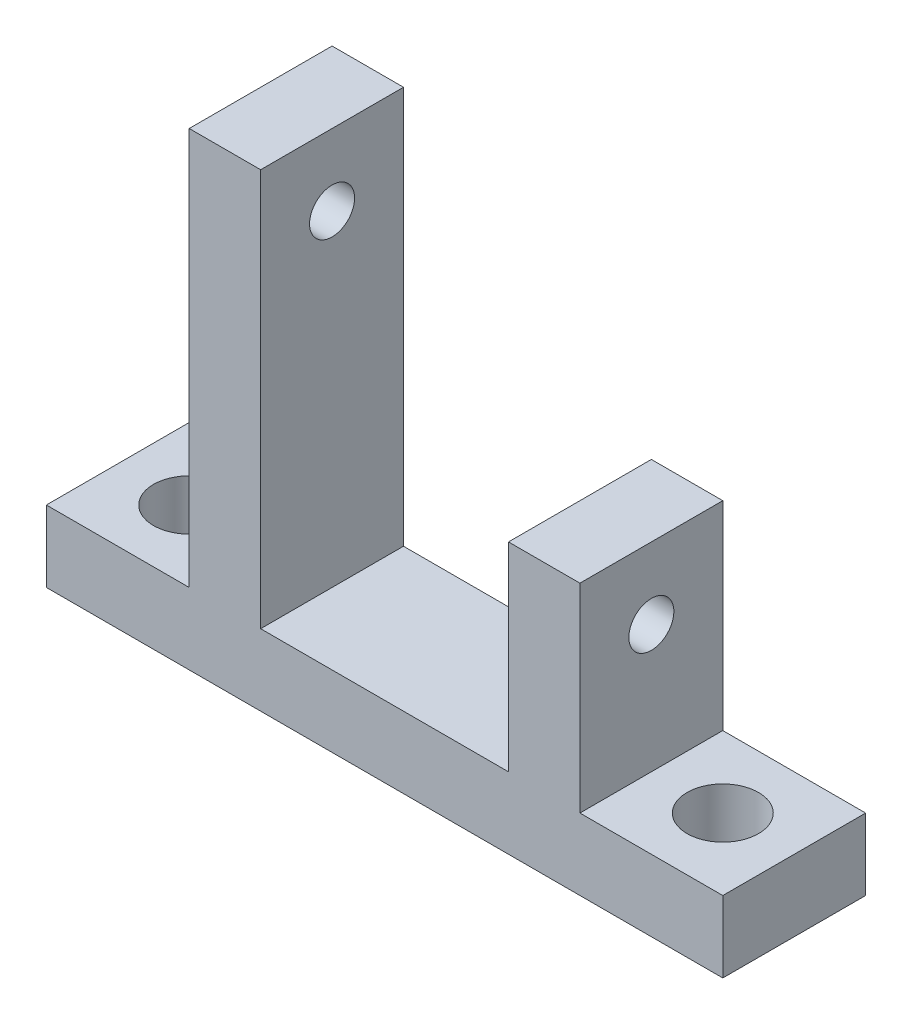
ISO-10303-21;
HEADER;
FILE_DESCRIPTION(('STEP AP214'),'2;1');
FILE_NAME('part.step','',(''),(''),'','','');
FILE_SCHEMA(('AUTOMOTIVE_DESIGN { 1 0 10303 214 1 1 1 1 }'));
ENDSEC;
DATA;
#1=APPLICATION_CONTEXT('core data for automotive mechanical design processes');
#2=APPLICATION_PROTOCOL_DEFINITION('international standard','automotive_design',2000,#1);
#3=PRODUCT_CONTEXT('',#1,'mechanical');
#4=PRODUCT('Part','Part','',(#3));
#5=PRODUCT_RELATED_PRODUCT_CATEGORY('part','',(#4));
#6=PRODUCT_DEFINITION_FORMATION('','',#4);
#7=PRODUCT_DEFINITION_CONTEXT('part definition',#1,'design');
#8=PRODUCT_DEFINITION('design','',#6,#7);
#9=PRODUCT_DEFINITION_SHAPE('','',#8);
#10=(LENGTH_UNIT() NAMED_UNIT(*) SI_UNIT(.MILLI.,.METRE.));
#11=(NAMED_UNIT(*) PLANE_ANGLE_UNIT() SI_UNIT($,.RADIAN.));
#12=(NAMED_UNIT(*) SI_UNIT($,.STERADIAN.) SOLID_ANGLE_UNIT());
#13=UNCERTAINTY_MEASURE_WITH_UNIT(LENGTH_MEASURE(1.E-05),#10,'distance_accuracy_value','');
#14=(GEOMETRIC_REPRESENTATION_CONTEXT(3) GLOBAL_UNCERTAINTY_ASSIGNED_CONTEXT((#13)) GLOBAL_UNIT_ASSIGNED_CONTEXT((#10,
#11,#12)) REPRESENTATION_CONTEXT('',''));
#15=CARTESIAN_POINT('',(0.,0.,0.));
#16=DIRECTION('',(0.,0.,1.));
#17=DIRECTION('',(1.,0.,0.));
#18=AXIS2_PLACEMENT_3D('',#15,#16,#17);
#19=CARTESIAN_POINT('',(0.,3.175,12.7));
#20=DIRECTION('',(0.,-1.,0.));
#21=DIRECTION('',(1.,0.,0.));
#22=AXIS2_PLACEMENT_3D('',#19,#20,#21);
#23=PLANE('',#22);
#24=DIRECTION('',(-1.,0.,0.));
#25=VECTOR('',#24,1.);
#26=CARTESIAN_POINT('',(0.,3.175,0.));
#27=LINE('',#26,#25);
#28=CARTESIAN_POINT('',(11.0166785,3.175,0.));
#29=VERTEX_POINT('',#28);
#30=CARTESIAN_POINT('',(-11.0166785,3.175,0.));
#31=VERTEX_POINT('',#30);
#32=EDGE_CURVE('E153',#29,#31,#27,.T.);
#33=ORIENTED_EDGE('',*,*,#32,.T.);
#34=DIRECTION('',(0.,0.,-1.));
#35=VECTOR('',#34,1.);
#36=CARTESIAN_POINT('',(-11.0166785,3.175,12.7));
#37=LINE('',#36,#35);
#38=CARTESIAN_POINT('',(-11.0166785,3.175,12.7));
#39=VERTEX_POINT('',#38);
#40=EDGE_CURVE('E11',#39,#31,#37,.T.);
#41=ORIENTED_EDGE('',*,*,#40,.F.);
#42=DIRECTION('',(-1.,0.,0.));
#43=VECTOR('',#42,1.);
#44=CARTESIAN_POINT('',(0.,3.175,12.7));
#45=LINE('',#44,#43);
#46=CARTESIAN_POINT('',(11.0166785,3.175,12.7));
#47=VERTEX_POINT('',#46);
#48=EDGE_CURVE('E100',#47,#39,#45,.T.);
#49=ORIENTED_EDGE('',*,*,#48,.F.);
#50=DIRECTION('',(0.,0.,-1.));
#51=VECTOR('',#50,1.);
#52=CARTESIAN_POINT('',(11.0166785,3.175,12.7));
#53=LINE('',#52,#51);
#54=EDGE_CURVE('E51',#47,#29,#53,.T.);
#55=ORIENTED_EDGE('',*,*,#54,.T.);
#56=EDGE_LOOP('',(#33,#41,#49,#55));
#57=FACE_BOUND('',#56,.T.);
#58=ADVANCED_FACE('F35',(#57),#23,.F.);
#59=CARTESIAN_POINT('',(-11.0166785,0.,12.7));
#60=DIRECTION('',(1.,0.,0.));
#61=DIRECTION('',(0.,0.,-1.));
#62=AXIS2_PLACEMENT_3D('',#59,#60,#61);
#63=PLANE('',#62);
#64=CARTESIAN_POINT('',(-11.0166785,32.16148,6.35));
#65=DIRECTION('',(1.,0.,0.));
#66=DIRECTION('',(0.,0.,-1.));
#67=AXIS2_PLACEMENT_3D('',#64,#65,#66);
#68=CIRCLE('',#67,2.);
#69=CARTESIAN_POINT('',(-11.0166785,32.16148,4.35));
#70=VERTEX_POINT('',#69);
#71=EDGE_CURVE('E317',#70,#70,#68,.F.);
#72=ORIENTED_EDGE('',*,*,#71,.T.);
#73=EDGE_LOOP('',(#72));
#74=FACE_BOUND('',#73,.T.);
#75=DIRECTION('',(0.,-1.,0.));
#76=VECTOR('',#75,1.);
#77=CARTESIAN_POINT('',(-11.0166785,0.,0.));
#78=LINE('',#77,#76);
#79=CARTESIAN_POINT('',(-11.0166785,38.51148,0.));
#80=VERTEX_POINT('',#79);
#81=EDGE_CURVE('E155',#80,#31,#78,.T.);
#82=ORIENTED_EDGE('',*,*,#81,.F.);
#83=DIRECTION('',(0.,0.,-1.));
#84=VECTOR('',#83,1.);
#85=CARTESIAN_POINT('',(-11.0166785,38.51148,12.7));
#86=LINE('',#85,#84);
#87=CARTESIAN_POINT('',(-11.0166785,38.51148,12.7));
#88=VERTEX_POINT('',#87);
#89=EDGE_CURVE('E43',#88,#80,#86,.T.);
#90=ORIENTED_EDGE('',*,*,#89,.F.);
#91=DIRECTION('',(0.,-1.,0.));
#92=VECTOR('',#91,1.);
#93=CARTESIAN_POINT('',(-11.0166785,0.,12.7));
#94=LINE('',#93,#92);
#95=EDGE_CURVE('E214',#88,#39,#94,.T.);
#96=ORIENTED_EDGE('',*,*,#95,.T.);
#97=ORIENTED_EDGE('',*,*,#40,.T.);
#98=EDGE_LOOP('',(#82,#90,#96,#97));
#99=FACE_BOUND('',#98,.T.);
#100=ADVANCED_FACE('F213',(#74,#99),#63,.T.);
#101=CARTESIAN_POINT('',(0.,38.51148,12.7));
#102=DIRECTION('',(0.,-1.,0.));
#103=DIRECTION('',(0.,0.,-1.));
#104=AXIS2_PLACEMENT_3D('',#101,#102,#103);
#105=PLANE('',#104);
#106=DIRECTION('',(-1.,0.,0.));
#107=VECTOR('',#106,1.);
#108=CARTESIAN_POINT('',(0.,38.51148,0.));
#109=LINE('',#108,#107);
#110=CARTESIAN_POINT('',(-17.3666785,38.51148,0.));
#111=VERTEX_POINT('',#110);
#112=EDGE_CURVE('E159',#80,#111,#109,.T.);
#113=ORIENTED_EDGE('',*,*,#112,.T.);
#114=DIRECTION('',(0.,0.,-1.));
#115=VECTOR('',#114,1.);
#116=CARTESIAN_POINT('',(-17.3666785,38.51148,12.7));
#117=LINE('',#116,#115);
#118=CARTESIAN_POINT('',(-17.3666785,38.51148,12.7));
#119=VERTEX_POINT('',#118);
#120=EDGE_CURVE('E199',#119,#111,#117,.T.);
#121=ORIENTED_EDGE('',*,*,#120,.F.);
#122=DIRECTION('',(-1.,0.,0.));
#123=VECTOR('',#122,1.);
#124=CARTESIAN_POINT('',(0.,38.51148,12.7));
#125=LINE('',#124,#123);
#126=EDGE_CURVE('E205',#88,#119,#125,.T.);
#127=ORIENTED_EDGE('',*,*,#126,.F.);
#128=ORIENTED_EDGE('',*,*,#89,.T.);
#129=EDGE_LOOP('',(#113,#121,#127,#128));
#130=FACE_BOUND('',#129,.T.);
#131=ADVANCED_FACE('F203',(#130),#105,.F.);
#132=CARTESIAN_POINT('',(-17.3666785,0.,12.7));
#133=DIRECTION('',(-1.,0.,0.));
#134=DIRECTION('',(0.,0.,1.));
#135=AXIS2_PLACEMENT_3D('',#132,#133,#134);
#136=PLANE('',#135);
#137=CARTESIAN_POINT('',(-17.3666785,32.16148,6.35));
#138=DIRECTION('',(-1.,0.,0.));
#139=DIRECTION('',(0.,0.,1.));
#140=AXIS2_PLACEMENT_3D('',#137,#138,#139);
#141=CIRCLE('',#140,2.);
#142=CARTESIAN_POINT('',(-17.3666785,32.16148,8.35));
#143=VERTEX_POINT('',#142);
#144=EDGE_CURVE('E309',#143,#143,#141,.T.);
#145=ORIENTED_EDGE('',*,*,#144,.F.);
#146=EDGE_LOOP('',(#145));
#147=FACE_BOUND('',#146,.T.);
#148=DIRECTION('',(0.,1.,0.));
#149=VECTOR('',#148,1.);
#150=CARTESIAN_POINT('',(-17.3666785,0.,0.));
#151=LINE('',#150,#149);
#152=CARTESIAN_POINT('',(-17.3666785,3.175,0.));
#153=VERTEX_POINT('',#152);
#154=EDGE_CURVE('E162',#153,#111,#151,.T.);
#155=ORIENTED_EDGE('',*,*,#154,.F.);
#156=DIRECTION('',(0.,0.,-1.));
#157=VECTOR('',#156,1.);
#158=CARTESIAN_POINT('',(-17.3666785,3.175,12.7));
#159=LINE('',#158,#157);
#160=CARTESIAN_POINT('',(-17.3666785,3.175,12.7));
#161=VERTEX_POINT('',#160);
#162=EDGE_CURVE('E197',#161,#153,#159,.T.);
#163=ORIENTED_EDGE('',*,*,#162,.F.);
#164=DIRECTION('',(0.,1.,0.));
#165=VECTOR('',#164,1.);
#166=CARTESIAN_POINT('',(-17.3666785,0.,12.7));
#167=LINE('',#166,#165);
#168=EDGE_CURVE('E280',#161,#119,#167,.T.);
#169=ORIENTED_EDGE('',*,*,#168,.T.);
#170=ORIENTED_EDGE('',*,*,#120,.T.);
#171=EDGE_LOOP('',(#155,#163,#169,#170));
#172=FACE_BOUND('',#171,.T.);
#173=ADVANCED_FACE('F235',(#147,#172),#136,.T.);
#174=CARTESIAN_POINT('',(0.,3.175,12.7));
#175=DIRECTION('',(0.,-1.,0.));
#176=DIRECTION('',(1.,0.,0.));
#177=AXIS2_PLACEMENT_3D('',#174,#175,#176);
#178=PLANE('',#177);
#179=CARTESIAN_POINT('',(-23.7166785,3.17499999999999,6.35000000000001));
#180=DIRECTION('',(0.,1.,0.));
#181=DIRECTION('',(-1.,0.,0.));
#182=AXIS2_PLACEMENT_3D('',#179,#180,#181);
#183=CIRCLE('',#182,3.175);
#184=CARTESIAN_POINT('',(-26.8916785,3.17499999999999,6.35000000000001));
#185=VERTEX_POINT('',#184);
#186=EDGE_CURVE('E271',#185,#185,#183,.T.);
#187=ORIENTED_EDGE('',*,*,#186,.F.);
#188=EDGE_LOOP('',(#187));
#189=FACE_BOUND('',#188,.T.);
#190=DIRECTION('',(-1.,0.,0.));
#191=VECTOR('',#190,1.);
#192=CARTESIAN_POINT('',(0.,3.175,0.));
#193=LINE('',#192,#191);
#194=CARTESIAN_POINT('',(-30.0666785,3.175,0.));
#195=VERTEX_POINT('',#194);
#196=EDGE_CURVE('E165',#153,#195,#193,.T.);
#197=ORIENTED_EDGE('',*,*,#196,.T.);
#198=DIRECTION('',(0.,0.,-1.));
#199=VECTOR('',#198,1.);
#200=CARTESIAN_POINT('',(-30.0666785,3.175,12.7));
#201=LINE('',#200,#199);
#202=CARTESIAN_POINT('',(-30.0666785,3.175,12.7));
#203=VERTEX_POINT('',#202);
#204=EDGE_CURVE('E195',#203,#195,#201,.T.);
#205=ORIENTED_EDGE('',*,*,#204,.F.);
#206=DIRECTION('',(-1.,0.,0.));
#207=VECTOR('',#206,1.);
#208=CARTESIAN_POINT('',(0.,3.175,12.7));
#209=LINE('',#208,#207);
#210=EDGE_CURVE('E283',#161,#203,#209,.T.);
#211=ORIENTED_EDGE('',*,*,#210,.F.);
#212=ORIENTED_EDGE('',*,*,#162,.T.);
#213=EDGE_LOOP('',(#197,#205,#211,#212));
#214=FACE_BOUND('',#213,.T.);
#215=ADVANCED_FACE('F241',(#189,#214),#178,.F.);
#216=CARTESIAN_POINT('',(-30.0666785,0.,12.7));
#217=DIRECTION('',(-1.,0.,0.));
#218=DIRECTION('',(0.,0.,1.));
#219=AXIS2_PLACEMENT_3D('',#216,#217,#218);
#220=PLANE('',#219);
#221=DIRECTION('',(0.,1.,0.));
#222=VECTOR('',#221,1.);
#223=CARTESIAN_POINT('',(-30.0666785,0.,0.));
#224=LINE('',#223,#222);
#225=CARTESIAN_POINT('',(-30.0666785,-3.175,0.));
#226=VERTEX_POINT('',#225);
#227=EDGE_CURVE('E168',#226,#195,#224,.T.);
#228=ORIENTED_EDGE('',*,*,#227,.F.);
#229=DIRECTION('',(0.,0.,-1.));
#230=VECTOR('',#229,1.);
#231=CARTESIAN_POINT('',(-30.0666785,-3.175,12.7));
#232=LINE('',#231,#230);
#233=CARTESIAN_POINT('',(-30.0666785,-3.175,12.7));
#234=VERTEX_POINT('',#233);
#235=EDGE_CURVE('E193',#234,#226,#232,.T.);
#236=ORIENTED_EDGE('',*,*,#235,.F.);
#237=DIRECTION('',(0.,1.,0.));
#238=VECTOR('',#237,1.);
#239=CARTESIAN_POINT('',(-30.0666785,0.,12.7));
#240=LINE('',#239,#238);
#241=EDGE_CURVE('E285',#234,#203,#240,.T.);
#242=ORIENTED_EDGE('',*,*,#241,.T.);
#243=ORIENTED_EDGE('',*,*,#204,.T.);
#244=EDGE_LOOP('',(#228,#236,#242,#243));
#245=FACE_BOUND('',#244,.T.);
#246=ADVANCED_FACE('F245',(#245),#220,.T.);
#247=CARTESIAN_POINT('',(0.,-3.175,12.7));
#248=DIRECTION('',(0.,-1.,0.));
#249=DIRECTION('',(1.,0.,0.));
#250=AXIS2_PLACEMENT_3D('',#247,#248,#249);
#251=PLANE('',#250);
#252=CARTESIAN_POINT('',(-23.7166785,-3.175,6.35000000000001));
#253=DIRECTION('',(0.,-1.,0.));
#254=DIRECTION('',(1.,0.,0.));
#255=AXIS2_PLACEMENT_3D('',#252,#253,#254);
#256=CIRCLE('',#255,3.175);
#257=CARTESIAN_POINT('',(-20.5416785,-3.175,6.35000000000001));
#258=VERTEX_POINT('',#257);
#259=EDGE_CURVE('E312',#258,#258,#256,.F.);
#260=ORIENTED_EDGE('',*,*,#259,.T.);
#261=EDGE_LOOP('',(#260));
#262=FACE_BOUND('',#261,.T.);
#263=CARTESIAN_POINT('',(23.7166785,-3.175,6.35));
#264=DIRECTION('',(0.,-1.,0.));
#265=DIRECTION('',(1.,0.,0.));
#266=AXIS2_PLACEMENT_3D('',#263,#264,#265);
#267=CIRCLE('',#266,3.175);
#268=CARTESIAN_POINT('',(26.8916785,-3.175,6.35));
#269=VERTEX_POINT('',#268);
#270=EDGE_CURVE('E274',#269,#269,#267,.F.);
#271=ORIENTED_EDGE('',*,*,#270,.T.);
#272=EDGE_LOOP('',(#271));
#273=FACE_BOUND('',#272,.T.);
#274=DIRECTION('',(-1.,0.,0.));
#275=VECTOR('',#274,1.);
#276=CARTESIAN_POINT('',(0.,-3.175,0.));
#277=LINE('',#276,#275);
#278=CARTESIAN_POINT('',(30.0666785,-3.175,0.));
#279=VERTEX_POINT('',#278);
#280=EDGE_CURVE('E171',#279,#226,#277,.T.);
#281=ORIENTED_EDGE('',*,*,#280,.F.);
#282=DIRECTION('',(0.,0.,-1.));
#283=VECTOR('',#282,1.);
#284=CARTESIAN_POINT('',(30.0666785,-3.175,12.7));
#285=LINE('',#284,#283);
#286=CARTESIAN_POINT('',(30.0666785,-3.175,12.7));
#287=VERTEX_POINT('',#286);
#288=EDGE_CURVE('E191',#287,#279,#285,.T.);
#289=ORIENTED_EDGE('',*,*,#288,.F.);
#290=DIRECTION('',(-1.,0.,0.));
#291=VECTOR('',#290,1.);
#292=CARTESIAN_POINT('',(0.,-3.175,12.7));
#293=LINE('',#292,#291);
#294=EDGE_CURVE('E288',#287,#234,#293,.T.);
#295=ORIENTED_EDGE('',*,*,#294,.T.);
#296=ORIENTED_EDGE('',*,*,#235,.T.);
#297=EDGE_LOOP('',(#281,#289,#295,#296));
#298=FACE_BOUND('',#297,.T.);
#299=ADVANCED_FACE('F249',(#262,#273,#298),#251,.T.);
#300=CARTESIAN_POINT('',(30.0666785,0.,12.7));
#301=DIRECTION('',(-1.,0.,0.));
#302=DIRECTION('',(0.,0.,1.));
#303=AXIS2_PLACEMENT_3D('',#300,#301,#302);
#304=PLANE('',#303);
#305=DIRECTION('',(0.,1.,0.));
#306=VECTOR('',#305,1.);
#307=CARTESIAN_POINT('',(30.0666785,0.,0.));
#308=LINE('',#307,#306);
#309=CARTESIAN_POINT('',(30.0666785,3.175,0.));
#310=VERTEX_POINT('',#309);
#311=EDGE_CURVE('E174',#279,#310,#308,.T.);
#312=ORIENTED_EDGE('',*,*,#311,.T.);
#313=DIRECTION('',(0.,0.,-1.));
#314=VECTOR('',#313,1.);
#315=CARTESIAN_POINT('',(30.0666785,3.175,12.7));
#316=LINE('',#315,#314);
#317=CARTESIAN_POINT('',(30.0666785,3.175,12.7));
#318=VERTEX_POINT('',#317);
#319=EDGE_CURVE('E189',#318,#310,#316,.T.);
#320=ORIENTED_EDGE('',*,*,#319,.F.);
#321=DIRECTION('',(0.,1.,0.));
#322=VECTOR('',#321,1.);
#323=CARTESIAN_POINT('',(30.0666785,0.,12.7));
#324=LINE('',#323,#322);
#325=EDGE_CURVE('E291',#287,#318,#324,.T.);
#326=ORIENTED_EDGE('',*,*,#325,.F.);
#327=ORIENTED_EDGE('',*,*,#288,.T.);
#328=EDGE_LOOP('',(#312,#320,#326,#327));
#329=FACE_BOUND('',#328,.T.);
#330=ADVANCED_FACE('F253',(#329),#304,.F.);
#331=CARTESIAN_POINT('',(0.,3.175,12.7));
#332=DIRECTION('',(0.,1.,0.));
#333=DIRECTION('',(-1.,0.,0.));
#334=AXIS2_PLACEMENT_3D('',#331,#332,#333);
#335=PLANE('',#334);
#336=CARTESIAN_POINT('',(23.7166785,3.17500000000001,6.35));
#337=DIRECTION('',(0.,1.,0.));
#338=DIRECTION('',(-1.,0.,0.));
#339=AXIS2_PLACEMENT_3D('',#336,#337,#338);
#340=CIRCLE('',#339,3.175);
#341=CARTESIAN_POINT('',(20.5416785,3.17500000000001,6.35));
#342=VERTEX_POINT('',#341);
#343=EDGE_CURVE('E308',#342,#342,#340,.T.);
#344=ORIENTED_EDGE('',*,*,#343,.F.);
#345=EDGE_LOOP('',(#344));
#346=FACE_BOUND('',#345,.T.);
#347=DIRECTION('',(1.,0.,0.));
#348=VECTOR('',#347,1.);
#349=CARTESIAN_POINT('',(0.,3.175,0.));
#350=LINE('',#349,#348);
#351=CARTESIAN_POINT('',(17.3666785,3.175,0.));
#352=VERTEX_POINT('',#351);
#353=EDGE_CURVE('E177',#352,#310,#350,.T.);
#354=ORIENTED_EDGE('',*,*,#353,.F.);
#355=DIRECTION('',(0.,0.,-1.));
#356=VECTOR('',#355,1.);
#357=CARTESIAN_POINT('',(17.3666785,3.175,12.7));
#358=LINE('',#357,#356);
#359=CARTESIAN_POINT('',(17.3666785,3.175,12.7));
#360=VERTEX_POINT('',#359);
#361=EDGE_CURVE('E145',#360,#352,#358,.T.);
#362=ORIENTED_EDGE('',*,*,#361,.F.);
#363=DIRECTION('',(1.,0.,0.));
#364=VECTOR('',#363,1.);
#365=CARTESIAN_POINT('',(0.,3.175,12.7));
#366=LINE('',#365,#364);
#367=EDGE_CURVE('E135',#360,#318,#366,.T.);
#368=ORIENTED_EDGE('',*,*,#367,.T.);
#369=ORIENTED_EDGE('',*,*,#319,.T.);
#370=EDGE_LOOP('',(#354,#362,#368,#369));
#371=FACE_BOUND('',#370,.T.);
#372=ADVANCED_FACE('F257',(#346,#371),#335,.T.);
#373=CARTESIAN_POINT('',(17.3666785,0.,12.7));
#374=DIRECTION('',(-1.,0.,0.));
#375=DIRECTION('',(0.,0.,1.));
#376=AXIS2_PLACEMENT_3D('',#373,#374,#375);
#377=PLANE('',#376);
#378=CARTESIAN_POINT('',(17.3666785,14.52372,6.35));
#379=DIRECTION('',(1.,0.,0.));
#380=DIRECTION('',(0.,1.,0.));
#381=AXIS2_PLACEMENT_3D('',#378,#379,#380);
#382=CIRCLE('',#381,2.);
#383=CARTESIAN_POINT('',(17.3666785,16.52372,6.35));
#384=VERTEX_POINT('',#383);
#385=EDGE_CURVE('E156',#384,#384,#382,.T.);
#386=ORIENTED_EDGE('',*,*,#385,.F.);
#387=EDGE_LOOP('',(#386));
#388=FACE_BOUND('',#387,.T.);
#389=DIRECTION('',(0.,1.,0.));
#390=VECTOR('',#389,1.);
#391=CARTESIAN_POINT('',(17.3666785,0.,0.));
#392=LINE('',#391,#390);
#393=CARTESIAN_POINT('',(17.3666785,20.87372,0.));
#394=VERTEX_POINT('',#393);
#395=EDGE_CURVE('E142',#352,#394,#392,.T.);
#396=ORIENTED_EDGE('',*,*,#395,.T.);
#397=DIRECTION('',(0.,0.,-1.));
#398=VECTOR('',#397,1.);
#399=CARTESIAN_POINT('',(17.3666785,20.87372,12.7));
#400=LINE('',#399,#398);
#401=CARTESIAN_POINT('',(17.3666785,20.87372,12.7));
#402=VERTEX_POINT('',#401);
#403=EDGE_CURVE('E139',#402,#394,#400,.T.);
#404=ORIENTED_EDGE('',*,*,#403,.F.);
#405=DIRECTION('',(0.,1.,0.));
#406=VECTOR('',#405,1.);
#407=CARTESIAN_POINT('',(17.3666785,0.,12.7));
#408=LINE('',#407,#406);
#409=EDGE_CURVE('E129',#360,#402,#408,.T.);
#410=ORIENTED_EDGE('',*,*,#409,.F.);
#411=ORIENTED_EDGE('',*,*,#361,.T.);
#412=EDGE_LOOP('',(#396,#404,#410,#411));
#413=FACE_BOUND('',#412,.T.);
#414=ADVANCED_FACE('F140',(#388,#413),#377,.F.);
#415=CARTESIAN_POINT('',(0.,20.87372,12.7));
#416=DIRECTION('',(0.,1.,0.));
#417=DIRECTION('',(-1.,0.,0.));
#418=AXIS2_PLACEMENT_3D('',#415,#416,#417);
#419=PLANE('',#418);
#420=DIRECTION('',(1.,0.,0.));
#421=VECTOR('',#420,1.);
#422=CARTESIAN_POINT('',(0.,20.87372,0.));
#423=LINE('',#422,#421);
#424=CARTESIAN_POINT('',(11.0166785,20.87372,0.));
#425=VERTEX_POINT('',#424);
#426=EDGE_CURVE('E181',#425,#394,#423,.T.);
#427=ORIENTED_EDGE('',*,*,#426,.F.);
#428=DIRECTION('',(0.,0.,-1.));
#429=VECTOR('',#428,1.);
#430=CARTESIAN_POINT('',(11.0166785,20.87372,12.7));
#431=LINE('',#430,#429);
#432=CARTESIAN_POINT('',(11.0166785,20.87372,12.7));
#433=VERTEX_POINT('',#432);
#434=EDGE_CURVE('E88',#433,#425,#431,.T.);
#435=ORIENTED_EDGE('',*,*,#434,.F.);
#436=DIRECTION('',(1.,0.,0.));
#437=VECTOR('',#436,1.);
#438=CARTESIAN_POINT('',(0.,20.87372,12.7));
#439=LINE('',#438,#437);
#440=EDGE_CURVE('E133',#433,#402,#439,.T.);
#441=ORIENTED_EDGE('',*,*,#440,.T.);
#442=ORIENTED_EDGE('',*,*,#403,.T.);
#443=EDGE_LOOP('',(#427,#435,#441,#442));
#444=FACE_BOUND('',#443,.T.);
#445=ADVANCED_FACE('F147',(#444),#419,.T.);
#446=CARTESIAN_POINT('',(11.0166785,0.,12.7));
#447=DIRECTION('',(-1.,0.,0.));
#448=DIRECTION('',(0.,0.,1.));
#449=AXIS2_PLACEMENT_3D('',#446,#447,#448);
#450=PLANE('',#449);
#451=CARTESIAN_POINT('',(11.0166785,14.52372,6.35));
#452=DIRECTION('',(-1.,0.,0.));
#453=DIRECTION('',(0.,0.,1.));
#454=AXIS2_PLACEMENT_3D('',#451,#452,#453);
#455=CIRCLE('',#454,2.);
#456=CARTESIAN_POINT('',(11.0166785,14.52372,8.35));
#457=VERTEX_POINT('',#456);
#458=EDGE_CURVE('E269',#457,#457,#455,.F.);
#459=ORIENTED_EDGE('',*,*,#458,.T.);
#460=EDGE_LOOP('',(#459));
#461=FACE_BOUND('',#460,.T.);
#462=DIRECTION('',(0.,1.,0.));
#463=VECTOR('',#462,1.);
#464=CARTESIAN_POINT('',(11.0166785,0.,0.));
#465=LINE('',#464,#463);
#466=EDGE_CURVE('E183',#29,#425,#465,.T.);
#467=ORIENTED_EDGE('',*,*,#466,.F.);
#468=ORIENTED_EDGE('',*,*,#54,.F.);
#469=DIRECTION('',(0.,1.,0.));
#470=VECTOR('',#469,1.);
#471=CARTESIAN_POINT('',(11.0166785,0.,12.7));
#472=LINE('',#471,#470);
#473=EDGE_CURVE('E148',#47,#433,#472,.T.);
#474=ORIENTED_EDGE('',*,*,#473,.T.);
#475=ORIENTED_EDGE('',*,*,#434,.T.);
#476=EDGE_LOOP('',(#467,#468,#474,#475));
#477=FACE_BOUND('',#476,.T.);
#478=ADVANCED_FACE('F215',(#461,#477),#450,.T.);
#479=CARTESIAN_POINT('',(0.,0.,12.7));
#480=DIRECTION('',(0.,0.,1.));
#481=DIRECTION('',(1.,0.,0.));
#482=AXIS2_PLACEMENT_3D('',#479,#480,#481);
#483=PLANE('',#482);
#484=ORIENTED_EDGE('',*,*,#48,.T.);
#485=ORIENTED_EDGE('',*,*,#95,.F.);
#486=ORIENTED_EDGE('',*,*,#126,.T.);
#487=ORIENTED_EDGE('',*,*,#168,.F.);
#488=ORIENTED_EDGE('',*,*,#210,.T.);
#489=ORIENTED_EDGE('',*,*,#241,.F.);
#490=ORIENTED_EDGE('',*,*,#294,.F.);
#491=ORIENTED_EDGE('',*,*,#325,.T.);
#492=ORIENTED_EDGE('',*,*,#367,.F.);
#493=ORIENTED_EDGE('',*,*,#409,.T.);
#494=ORIENTED_EDGE('',*,*,#440,.F.);
#495=ORIENTED_EDGE('',*,*,#473,.F.);
#496=EDGE_LOOP('',(#484,#485,#486,#487,#488,#489,#490,#491,#492,#493,#494,#495));
#497=FACE_BOUND('',#496,.T.);
#498=ADVANCED_FACE('F131',(#497),#483,.T.);
#499=CARTESIAN_POINT('',(0.,0.,0.));
#500=DIRECTION('',(0.,0.,1.));
#501=DIRECTION('',(1.,0.,0.));
#502=AXIS2_PLACEMENT_3D('',#499,#500,#501);
#503=PLANE('',#502);
#504=ORIENTED_EDGE('',*,*,#32,.F.);
#505=ORIENTED_EDGE('',*,*,#466,.T.);
#506=ORIENTED_EDGE('',*,*,#426,.T.);
#507=ORIENTED_EDGE('',*,*,#395,.F.);
#508=ORIENTED_EDGE('',*,*,#353,.T.);
#509=ORIENTED_EDGE('',*,*,#311,.F.);
#510=ORIENTED_EDGE('',*,*,#280,.T.);
#511=ORIENTED_EDGE('',*,*,#227,.T.);
#512=ORIENTED_EDGE('',*,*,#196,.F.);
#513=ORIENTED_EDGE('',*,*,#154,.T.);
#514=ORIENTED_EDGE('',*,*,#112,.F.);
#515=ORIENTED_EDGE('',*,*,#81,.T.);
#516=EDGE_LOOP('',(#504,#505,#506,#507,#508,#509,#510,#511,#512,#513,#514,#515));
#517=FACE_BOUND('',#516,.T.);
#518=ADVANCED_FACE('F210',(#517),#503,.F.);
#519=CARTESIAN_POINT('',(-30.0676785,14.52372,6.35));
#520=DIRECTION('',(1.,0.,0.));
#521=DIRECTION('',(0.,1.,0.));
#522=AXIS2_PLACEMENT_3D('',#519,#520,#521);
#523=CYLINDRICAL_SURFACE('',#522,2.);
#524=ORIENTED_EDGE('',*,*,#458,.F.);
#525=EDGE_LOOP('',(#524));
#526=FACE_BOUND('',#525,.T.);
#527=ORIENTED_EDGE('',*,*,#385,.T.);
#528=EDGE_LOOP('',(#527));
#529=FACE_BOUND('',#528,.T.);
#530=ADVANCED_FACE('F337',(#526,#529),#523,.F.);
#531=CARTESIAN_POINT('',(23.7166785,-3.17600000000001,6.35));
#532=DIRECTION('',(0.,1.,0.));
#533=DIRECTION('',(-1.,0.,0.));
#534=AXIS2_PLACEMENT_3D('',#531,#532,#533);
#535=CYLINDRICAL_SURFACE('',#534,3.175);
#536=ORIENTED_EDGE('',*,*,#270,.F.);
#537=EDGE_LOOP('',(#536));
#538=FACE_BOUND('',#537,.T.);
#539=ORIENTED_EDGE('',*,*,#343,.T.);
#540=EDGE_LOOP('',(#539));
#541=FACE_BOUND('',#540,.T.);
#542=ADVANCED_FACE('F330',(#538,#541),#535,.F.);
#543=CARTESIAN_POINT('',(-23.7166785,-3.17600000000003,6.35000000000001));
#544=DIRECTION('',(0.,1.,0.));
#545=DIRECTION('',(-1.,0.,0.));
#546=AXIS2_PLACEMENT_3D('',#543,#544,#545);
#547=CYLINDRICAL_SURFACE('',#546,3.175);
#548=ORIENTED_EDGE('',*,*,#259,.F.);
#549=EDGE_LOOP('',(#548));
#550=FACE_BOUND('',#549,.T.);
#551=ORIENTED_EDGE('',*,*,#186,.T.);
#552=EDGE_LOOP('',(#551));
#553=FACE_BOUND('',#552,.T.);
#554=ADVANCED_FACE('F324',(#550,#553),#547,.F.);
#555=CARTESIAN_POINT('',(30.0676785,32.16148,6.35));
#556=DIRECTION('',(-1.,0.,0.));
#557=DIRECTION('',(0.,0.,1.));
#558=AXIS2_PLACEMENT_3D('',#555,#556,#557);
#559=CYLINDRICAL_SURFACE('',#558,2.);
#560=ORIENTED_EDGE('',*,*,#71,.F.);
#561=EDGE_LOOP('',(#560));
#562=FACE_BOUND('',#561,.T.);
#563=ORIENTED_EDGE('',*,*,#144,.T.);
#564=EDGE_LOOP('',(#563));
#565=FACE_BOUND('',#564,.T.);
#566=ADVANCED_FACE('F322',(#562,#565),#559,.F.);
#567=CLOSED_SHELL('',(#58,#100,#131,#173,#215,#246,#299,#330,#372,#414,#445,#478,#498,#518,#530,
#542,#554,#566));
#568=MANIFOLD_SOLID_BREP('B2',#567);
#569=ADVANCED_BREP_SHAPE_REPRESENTATION('',(#18,#568),#14);
#570=SHAPE_DEFINITION_REPRESENTATION(#9,#569);
ENDSEC;
END-ISO-10303-21;
